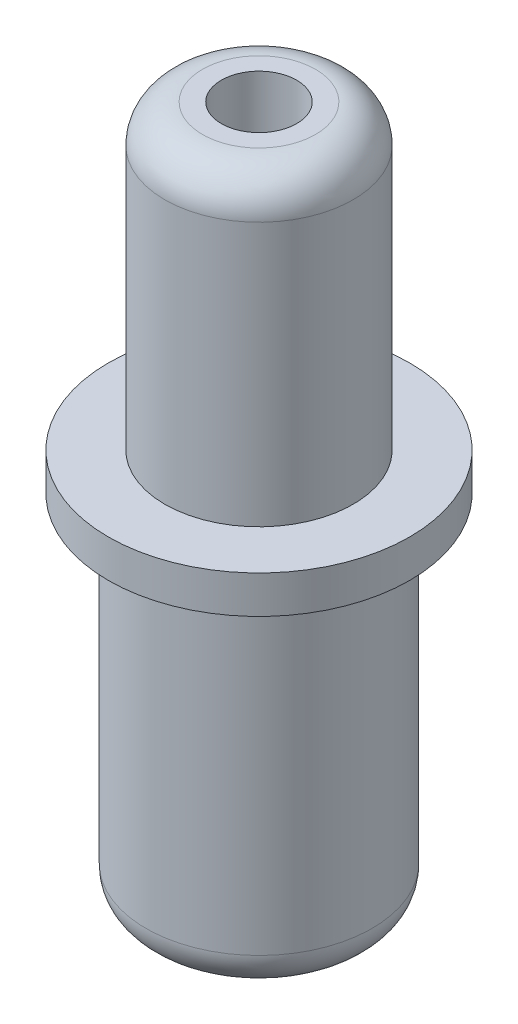
ISO-10303-21;
HEADER;
FILE_DESCRIPTION(('STEP AP214'),'2;1');
FILE_NAME('part.step','',(''),(''),'','','');
FILE_SCHEMA(('AUTOMOTIVE_DESIGN { 1 0 10303 214 1 1 1 1 }'));
ENDSEC;
DATA;
#1=APPLICATION_CONTEXT('core data for automotive mechanical design processes');
#2=APPLICATION_PROTOCOL_DEFINITION('international standard','automotive_design',2000,#1);
#3=PRODUCT_CONTEXT('',#1,'mechanical');
#4=PRODUCT('Part','Part','',(#3));
#5=PRODUCT_RELATED_PRODUCT_CATEGORY('part','',(#4));
#6=PRODUCT_DEFINITION_FORMATION('','',#4);
#7=PRODUCT_DEFINITION_CONTEXT('part definition',#1,'design');
#8=PRODUCT_DEFINITION('design','',#6,#7);
#9=PRODUCT_DEFINITION_SHAPE('','',#8);
#10=(LENGTH_UNIT() NAMED_UNIT(*) SI_UNIT(.MILLI.,.METRE.));
#11=(NAMED_UNIT(*) PLANE_ANGLE_UNIT() SI_UNIT($,.RADIAN.));
#12=(NAMED_UNIT(*) SI_UNIT($,.STERADIAN.) SOLID_ANGLE_UNIT());
#13=UNCERTAINTY_MEASURE_WITH_UNIT(LENGTH_MEASURE(1.E-05),#10,'distance_accuracy_value','');
#14=(GEOMETRIC_REPRESENTATION_CONTEXT(3) GLOBAL_UNCERTAINTY_ASSIGNED_CONTEXT((#13)) GLOBAL_UNIT_ASSIGNED_CONTEXT((#10,
#11,#12)) REPRESENTATION_CONTEXT('',''));
#15=CARTESIAN_POINT('',(0.,0.,0.));
#16=DIRECTION('',(0.,0.,1.));
#17=DIRECTION('',(1.,0.,0.));
#18=AXIS2_PLACEMENT_3D('',#15,#16,#17);
#19=CARTESIAN_POINT('',(0.,-0.5,0.));
#20=DIRECTION('',(0.,-1.,0.));
#21=DIRECTION('',(0.,0.,-1.));
#22=AXIS2_PLACEMENT_3D('',#19,#20,#21);
#23=TOROIDAL_SURFACE('',#22,2.,1.);
#24=CARTESIAN_POINT('',(0.,-0.499999999999993,0.));
#25=DIRECTION('',(0.,-1.,0.));
#26=DIRECTION('',(0.,0.,-1.));
#27=AXIS2_PLACEMENT_3D('',#24,#25,#26);
#28=CIRCLE('',#27,3.);
#29=CARTESIAN_POINT('',(0.,-0.499999999999993,-3.));
#30=VERTEX_POINT('',#29);
#31=EDGE_CURVE('E12',#30,#30,#28,.T.);
#32=ORIENTED_EDGE('',*,*,#31,.T.);
#33=EDGE_LOOP('',(#32));
#34=FACE_BOUND('',#33,.T.);
#35=CARTESIAN_POINT('',(0.,-1.5,0.));
#36=DIRECTION('',(0.,-1.,0.));
#37=DIRECTION('',(0.,0.,-1.));
#38=AXIS2_PLACEMENT_3D('',#35,#36,#37);
#39=CIRCLE('',#38,1.99999999999999);
#40=CARTESIAN_POINT('',(0.,-1.5,-1.99999999999999));
#41=VERTEX_POINT('',#40);
#42=EDGE_CURVE('E74',#41,#41,#39,.T.);
#43=ORIENTED_EDGE('',*,*,#42,.F.);
#44=EDGE_LOOP('',(#43));
#45=FACE_BOUND('',#44,.T.);
#46=ADVANCED_FACE('F40',(#34,#45),#23,.T.);
#47=CARTESIAN_POINT('',(0.,0.,0.));
#48=DIRECTION('',(0.,-1.,0.));
#49=DIRECTION('',(0.,0.,-1.));
#50=AXIS2_PLACEMENT_3D('',#47,#48,#49);
#51=CYLINDRICAL_SURFACE('',#50,3.);
#52=CARTESIAN_POINT('',(0.,8.,0.));
#53=DIRECTION('',(0.,-1.,0.));
#54=DIRECTION('',(0.,0.,-1.));
#55=AXIS2_PLACEMENT_3D('',#52,#53,#54);
#56=CIRCLE('',#55,3.);
#57=CARTESIAN_POINT('',(0.,8.,-3.));
#58=VERTEX_POINT('',#57);
#59=EDGE_CURVE('E46',#58,#58,#56,.T.);
#60=ORIENTED_EDGE('',*,*,#59,.T.);
#61=EDGE_LOOP('',(#60));
#62=FACE_BOUND('',#61,.T.);
#63=ORIENTED_EDGE('',*,*,#31,.F.);
#64=EDGE_LOOP('',(#63));
#65=FACE_BOUND('',#64,.T.);
#66=ADVANCED_FACE('F82',(#62,#65),#51,.T.);
#67=CARTESIAN_POINT('',(0.,8.,-4.));
#68=DIRECTION('',(0.,-1.,0.));
#69=DIRECTION('',(0.,0.,-1.));
#70=AXIS2_PLACEMENT_3D('',#67,#68,#69);
#71=PLANE('',#70);
#72=CARTESIAN_POINT('',(0.,8.,0.));
#73=DIRECTION('',(0.,-1.,0.));
#74=DIRECTION('',(0.,0.,-1.));
#75=AXIS2_PLACEMENT_3D('',#72,#73,#74);
#76=CIRCLE('',#75,4.);
#77=CARTESIAN_POINT('',(0.,8.,-4.));
#78=VERTEX_POINT('',#77);
#79=EDGE_CURVE('E50',#78,#78,#76,.T.);
#80=ORIENTED_EDGE('',*,*,#79,.T.);
#81=EDGE_LOOP('',(#80));
#82=FACE_BOUND('',#81,.T.);
#83=ORIENTED_EDGE('',*,*,#59,.F.);
#84=EDGE_LOOP('',(#83));
#85=FACE_BOUND('',#84,.T.);
#86=ADVANCED_FACE('F86',(#82,#85),#71,.T.);
#87=CARTESIAN_POINT('',(0.,0.,0.));
#88=DIRECTION('',(0.,-1.,0.));
#89=DIRECTION('',(0.,0.,-1.));
#90=AXIS2_PLACEMENT_3D('',#87,#88,#89);
#91=CYLINDRICAL_SURFACE('',#90,4.);
#92=CARTESIAN_POINT('',(0.,9.,0.));
#93=DIRECTION('',(0.,-1.,0.));
#94=DIRECTION('',(0.,0.,-1.));
#95=AXIS2_PLACEMENT_3D('',#92,#93,#94);
#96=CIRCLE('',#95,4.);
#97=CARTESIAN_POINT('',(0.,9.,-4.));
#98=VERTEX_POINT('',#97);
#99=EDGE_CURVE('E54',#98,#98,#96,.T.);
#100=ORIENTED_EDGE('',*,*,#99,.T.);
#101=EDGE_LOOP('',(#100));
#102=FACE_BOUND('',#101,.T.);
#103=ORIENTED_EDGE('',*,*,#79,.F.);
#104=EDGE_LOOP('',(#103));
#105=FACE_BOUND('',#104,.T.);
#106=ADVANCED_FACE('F90',(#102,#105),#91,.T.);
#107=CARTESIAN_POINT('',(0.,9.,-2.5));
#108=DIRECTION('',(0.,1.,0.));
#109=DIRECTION('',(0.,0.,1.));
#110=AXIS2_PLACEMENT_3D('',#107,#108,#109);
#111=PLANE('',#110);
#112=CARTESIAN_POINT('',(0.,9.,0.));
#113=DIRECTION('',(0.,-1.,0.));
#114=DIRECTION('',(0.,0.,-1.));
#115=AXIS2_PLACEMENT_3D('',#112,#113,#114);
#116=CIRCLE('',#115,2.5);
#117=CARTESIAN_POINT('',(0.,9.,-2.5));
#118=VERTEX_POINT('',#117);
#119=EDGE_CURVE('E59',#118,#118,#116,.T.);
#120=ORIENTED_EDGE('',*,*,#119,.T.);
#121=EDGE_LOOP('',(#120));
#122=FACE_BOUND('',#121,.T.);
#123=ORIENTED_EDGE('',*,*,#99,.F.);
#124=EDGE_LOOP('',(#123));
#125=FACE_BOUND('',#124,.T.);
#126=ADVANCED_FACE('F97',(#122,#125),#111,.T.);
#127=CARTESIAN_POINT('',(0.,0.,0.));
#128=DIRECTION('',(0.,-1.,0.));
#129=DIRECTION('',(0.,0.,-1.));
#130=AXIS2_PLACEMENT_3D('',#127,#128,#129);
#131=CYLINDRICAL_SURFACE('',#130,2.5);
#132=CARTESIAN_POINT('',(0.,16.,0.));
#133=DIRECTION('',(0.,-1.,0.));
#134=DIRECTION('',(0.,0.,-1.));
#135=AXIS2_PLACEMENT_3D('',#132,#133,#134);
#136=CIRCLE('',#135,2.5);
#137=CARTESIAN_POINT('',(0.,16.,-2.5));
#138=VERTEX_POINT('',#137);
#139=EDGE_CURVE('E62',#138,#138,#136,.T.);
#140=ORIENTED_EDGE('',*,*,#139,.T.);
#141=EDGE_LOOP('',(#140));
#142=FACE_BOUND('',#141,.T.);
#143=ORIENTED_EDGE('',*,*,#119,.F.);
#144=EDGE_LOOP('',(#143));
#145=FACE_BOUND('',#144,.T.);
#146=ADVANCED_FACE('F101',(#142,#145),#131,.T.);
#147=CARTESIAN_POINT('',(0.,16.,0.));
#148=DIRECTION('',(0.,-1.,0.));
#149=DIRECTION('',(0.,0.,-1.));
#150=AXIS2_PLACEMENT_3D('',#147,#148,#149);
#151=TOROIDAL_SURFACE('',#150,1.5,1.);
#152=CARTESIAN_POINT('',(0.,17.,0.));
#153=DIRECTION('',(0.,-1.,0.));
#154=DIRECTION('',(0.,0.,-1.));
#155=AXIS2_PLACEMENT_3D('',#152,#153,#154);
#156=CIRCLE('',#155,1.49999999999999);
#157=CARTESIAN_POINT('',(0.,17.,-1.49999999999999));
#158=VERTEX_POINT('',#157);
#159=EDGE_CURVE('E65',#158,#158,#156,.T.);
#160=ORIENTED_EDGE('',*,*,#159,.T.);
#161=EDGE_LOOP('',(#160));
#162=FACE_BOUND('',#161,.T.);
#163=ORIENTED_EDGE('',*,*,#139,.F.);
#164=EDGE_LOOP('',(#163));
#165=FACE_BOUND('',#164,.T.);
#166=ADVANCED_FACE('F105',(#162,#165),#151,.T.);
#167=CARTESIAN_POINT('',(0.,17.,-1.49999999999999));
#168=DIRECTION('',(0.,1.,0.));
#169=DIRECTION('',(0.,0.,1.));
#170=AXIS2_PLACEMENT_3D('',#167,#168,#169);
#171=PLANE('',#170);
#172=CARTESIAN_POINT('',(0.,17.,0.));
#173=DIRECTION('',(0.,-1.,0.));
#174=DIRECTION('',(0.,0.,-1.));
#175=AXIS2_PLACEMENT_3D('',#172,#173,#174);
#176=CIRCLE('',#175,1.);
#177=CARTESIAN_POINT('',(0.,17.,-1.));
#178=VERTEX_POINT('',#177);
#179=EDGE_CURVE('E68',#178,#178,#176,.T.);
#180=ORIENTED_EDGE('',*,*,#179,.T.);
#181=EDGE_LOOP('',(#180));
#182=FACE_BOUND('',#181,.T.);
#183=ORIENTED_EDGE('',*,*,#159,.F.);
#184=EDGE_LOOP('',(#183));
#185=FACE_BOUND('',#184,.T.);
#186=ADVANCED_FACE('F109',(#182,#185),#171,.T.);
#187=CARTESIAN_POINT('',(0.,0.,0.));
#188=DIRECTION('',(0.,-1.,0.));
#189=DIRECTION('',(0.,0.,-1.));
#190=AXIS2_PLACEMENT_3D('',#187,#188,#189);
#191=CYLINDRICAL_SURFACE('',#190,1.);
#192=CARTESIAN_POINT('',(0.,-1.5,0.));
#193=DIRECTION('',(0.,-1.,0.));
#194=DIRECTION('',(0.,0.,-1.));
#195=AXIS2_PLACEMENT_3D('',#192,#193,#194);
#196=CIRCLE('',#195,1.);
#197=CARTESIAN_POINT('',(0.,-1.5,-1.));
#198=VERTEX_POINT('',#197);
#199=EDGE_CURVE('E71',#198,#198,#196,.T.);
#200=ORIENTED_EDGE('',*,*,#199,.T.);
#201=EDGE_LOOP('',(#200));
#202=FACE_BOUND('',#201,.T.);
#203=ORIENTED_EDGE('',*,*,#179,.F.);
#204=EDGE_LOOP('',(#203));
#205=FACE_BOUND('',#204,.T.);
#206=ADVANCED_FACE('F113',(#202,#205),#191,.F.);
#207=CARTESIAN_POINT('',(0.,-1.5,-1.99999999999999));
#208=DIRECTION('',(0.,-1.,0.));
#209=DIRECTION('',(0.,0.,-1.));
#210=AXIS2_PLACEMENT_3D('',#207,#208,#209);
#211=PLANE('',#210);
#212=ORIENTED_EDGE('',*,*,#42,.T.);
#213=EDGE_LOOP('',(#212));
#214=FACE_BOUND('',#213,.T.);
#215=ORIENTED_EDGE('',*,*,#199,.F.);
#216=EDGE_LOOP('',(#215));
#217=FACE_BOUND('',#216,.T.);
#218=ADVANCED_FACE('F78',(#214,#217),#211,.T.);
#219=CLOSED_SHELL('',(#46,#66,#86,#106,#126,#146,#166,#186,#206,#218));
#220=MANIFOLD_SOLID_BREP('B2',#219);
#221=ADVANCED_BREP_SHAPE_REPRESENTATION('',(#18,#220),#14);
#222=SHAPE_DEFINITION_REPRESENTATION(#9,#221);
ENDSEC;
END-ISO-10303-21;
